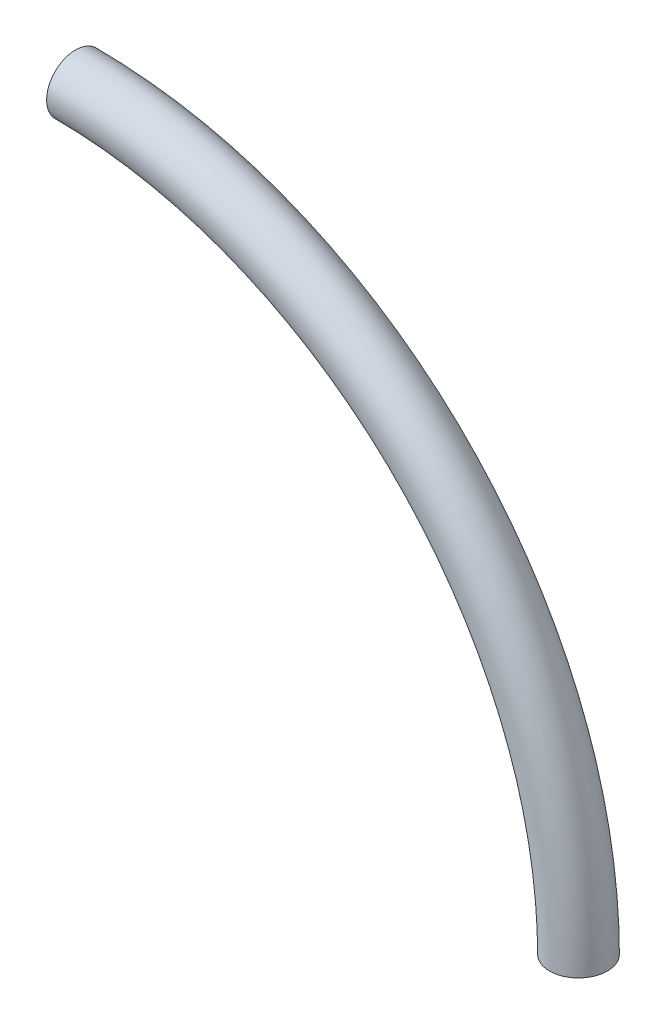
ISO-10303-21;
HEADER;
FILE_DESCRIPTION(('STEP AP214'),'2;1');
FILE_NAME('part.step','',(''),(''),'','','');
FILE_SCHEMA(('AUTOMOTIVE_DESIGN { 1 0 10303 214 1 1 1 1 }'));
ENDSEC;
DATA;
#1=APPLICATION_CONTEXT('core data for automotive mechanical design processes');
#2=APPLICATION_PROTOCOL_DEFINITION('international standard','automotive_design',2000,#1);
#3=PRODUCT_CONTEXT('',#1,'mechanical');
#4=PRODUCT('Part','Part','',(#3));
#5=PRODUCT_RELATED_PRODUCT_CATEGORY('part','',(#4));
#6=PRODUCT_DEFINITION_FORMATION('','',#4);
#7=PRODUCT_DEFINITION_CONTEXT('part definition',#1,'design');
#8=PRODUCT_DEFINITION('design','',#6,#7);
#9=PRODUCT_DEFINITION_SHAPE('','',#8);
#10=(LENGTH_UNIT() NAMED_UNIT(*) SI_UNIT(.MILLI.,.METRE.));
#11=(NAMED_UNIT(*) PLANE_ANGLE_UNIT() SI_UNIT($,.RADIAN.));
#12=(NAMED_UNIT(*) SI_UNIT($,.STERADIAN.) SOLID_ANGLE_UNIT());
#13=UNCERTAINTY_MEASURE_WITH_UNIT(LENGTH_MEASURE(1.E-05),#10,'distance_accuracy_value','');
#14=(GEOMETRIC_REPRESENTATION_CONTEXT(3) GLOBAL_UNCERTAINTY_ASSIGNED_CONTEXT((#13)) GLOBAL_UNIT_ASSIGNED_CONTEXT((#10,
#11,#12)) REPRESENTATION_CONTEXT('',''));
#15=CARTESIAN_POINT('',(0.,0.,0.));
#16=DIRECTION('',(0.,0.,1.));
#17=DIRECTION('',(1.,0.,0.));
#18=AXIS2_PLACEMENT_3D('',#15,#16,#17);
#19=CARTESIAN_POINT('',(0.,0.,0.));
#20=DIRECTION('',(0.,0.,-1.));
#21=DIRECTION('',(-1.,0.,0.));
#22=AXIS2_PLACEMENT_3D('',#19,#20,#21);
#23=TOROIDAL_SURFACE('',#22,200.,11.5);
#24=CARTESIAN_POINT('',(200.,0.,0.));
#25=DIRECTION('',(0.,1.,0.));
#26=DIRECTION('',(0.,0.,1.));
#27=AXIS2_PLACEMENT_3D('',#24,#25,#26);
#28=CIRCLE('',#27,11.5);
#29=CARTESIAN_POINT('',(200.,0.,11.5));
#30=VERTEX_POINT('',#29);
#31=EDGE_CURVE('E51',#30,#30,#28,.T.);
#32=ORIENTED_EDGE('',*,*,#31,.T.);
#33=EDGE_LOOP('',(#32));
#34=FACE_BOUND('',#33,.T.);
#35=CARTESIAN_POINT('',(1.01064309961486E-13,200.,0.));
#36=DIRECTION('',(-1.,0.,0.));
#37=DIRECTION('',(0.,0.,1.));
#38=AXIS2_PLACEMENT_3D('',#35,#36,#37);
#39=CIRCLE('',#38,11.5);
#40=CARTESIAN_POINT('',(1.01064309961486E-13,200.,11.5));
#41=VERTEX_POINT('',#40);
#42=EDGE_CURVE('E36',#41,#41,#39,.T.);
#43=ORIENTED_EDGE('',*,*,#42,.F.);
#44=EDGE_LOOP('',(#43));
#45=FACE_BOUND('',#44,.T.);
#46=ADVANCED_FACE('F33',(#34,#45),#23,.T.);
#47=CARTESIAN_POINT('',(1.01064309961486E-13,200.,0.));
#48=DIRECTION('',(-1.,0.,0.));
#49=DIRECTION('',(0.,0.,1.));
#50=AXIS2_PLACEMENT_3D('',#47,#48,#49);
#51=PLANE('',#50);
#52=CARTESIAN_POINT('',(1.01064309961486E-13,200.,0.));
#53=DIRECTION('',(-1.,0.,0.));
#54=DIRECTION('',(0.,0.,1.));
#55=AXIS2_PLACEMENT_3D('',#52,#53,#54);
#56=CIRCLE('',#55,8.50000000000001);
#57=CARTESIAN_POINT('',(1.01064309961486E-13,200.,8.50000000000001));
#58=VERTEX_POINT('',#57);
#59=EDGE_CURVE('E41',#58,#58,#56,.F.);
#60=ORIENTED_EDGE('',*,*,#59,.T.);
#61=EDGE_LOOP('',(#60));
#62=FACE_BOUND('',#61,.T.);
#63=ORIENTED_EDGE('',*,*,#42,.T.);
#64=EDGE_LOOP('',(#63));
#65=FACE_BOUND('',#64,.T.);
#66=ADVANCED_FACE('F63',(#62,#65),#51,.T.);
#67=CARTESIAN_POINT('',(200.,0.,0.));
#68=DIRECTION('',(0.,1.,0.));
#69=DIRECTION('',(0.,0.,1.));
#70=AXIS2_PLACEMENT_3D('',#67,#68,#69);
#71=PLANE('',#70);
#72=CARTESIAN_POINT('',(200.,0.,0.));
#73=DIRECTION('',(0.,1.,0.));
#74=DIRECTION('',(0.,0.,1.));
#75=AXIS2_PLACEMENT_3D('',#72,#73,#74);
#76=CIRCLE('',#75,8.50000000000001);
#77=CARTESIAN_POINT('',(200.,0.,8.50000000000001));
#78=VERTEX_POINT('',#77);
#79=EDGE_CURVE('E11',#78,#78,#76,.F.);
#80=ORIENTED_EDGE('',*,*,#79,.F.);
#81=EDGE_LOOP('',(#80));
#82=FACE_BOUND('',#81,.T.);
#83=ORIENTED_EDGE('',*,*,#31,.F.);
#84=EDGE_LOOP('',(#83));
#85=FACE_BOUND('',#84,.T.);
#86=ADVANCED_FACE('F61',(#82,#85),#71,.F.);
#87=CARTESIAN_POINT('',(0.,0.,0.));
#88=DIRECTION('',(0.,0.,-1.));
#89=DIRECTION('',(-1.,0.,0.));
#90=AXIS2_PLACEMENT_3D('',#87,#88,#89);
#91=TOROIDAL_SURFACE('',#90,200.,8.50000000000001);
#92=ORIENTED_EDGE('',*,*,#79,.T.);
#93=EDGE_LOOP('',(#92));
#94=FACE_BOUND('',#93,.T.);
#95=ORIENTED_EDGE('',*,*,#59,.F.);
#96=EDGE_LOOP('',(#95));
#97=FACE_BOUND('',#96,.T.);
#98=ADVANCED_FACE('F58',(#94,#97),#91,.F.);
#99=CLOSED_SHELL('',(#46,#66,#86,#98));
#100=MANIFOLD_SOLID_BREP('B2',#99);
#101=ADVANCED_BREP_SHAPE_REPRESENTATION('',(#18,#100),#14);
#102=SHAPE_DEFINITION_REPRESENTATION(#9,#101);
ENDSEC;
END-ISO-10303-21;
